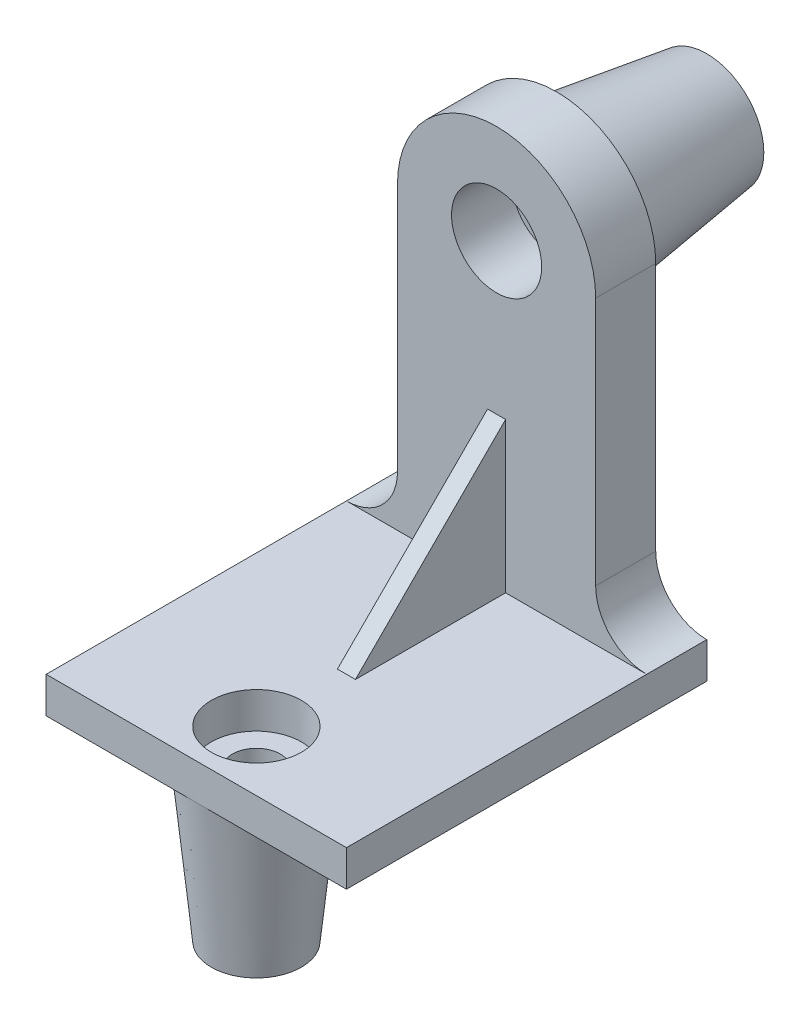
ISO-10303-21;
HEADER;
FILE_DESCRIPTION(('STEP AP214'),'2;1');
FILE_NAME('part.step','',(''),(''),'','','');
FILE_SCHEMA(('AUTOMOTIVE_DESIGN { 1 0 10303 214 1 1 1 1 }'));
ENDSEC;
DATA;
#1=APPLICATION_CONTEXT('core data for automotive mechanical design processes');
#2=APPLICATION_PROTOCOL_DEFINITION('international standard','automotive_design',2000,#1);
#3=PRODUCT_CONTEXT('',#1,'mechanical');
#4=PRODUCT('Part','Part','',(#3));
#5=PRODUCT_RELATED_PRODUCT_CATEGORY('part','',(#4));
#6=PRODUCT_DEFINITION_FORMATION('','',#4);
#7=PRODUCT_DEFINITION_CONTEXT('part definition',#1,'design');
#8=PRODUCT_DEFINITION('design','',#6,#7);
#9=PRODUCT_DEFINITION_SHAPE('','',#8);
#10=(LENGTH_UNIT() NAMED_UNIT(*) SI_UNIT(.MILLI.,.METRE.));
#11=(NAMED_UNIT(*) PLANE_ANGLE_UNIT() SI_UNIT($,.RADIAN.));
#12=(NAMED_UNIT(*) SI_UNIT($,.STERADIAN.) SOLID_ANGLE_UNIT());
#13=UNCERTAINTY_MEASURE_WITH_UNIT(LENGTH_MEASURE(1.E-05),#10,'distance_accuracy_value','');
#14=(GEOMETRIC_REPRESENTATION_CONTEXT(3) GLOBAL_UNCERTAINTY_ASSIGNED_CONTEXT((#13)) GLOBAL_UNIT_ASSIGNED_CONTEXT((#10,
#11,#12)) REPRESENTATION_CONTEXT('',''));
#15=CARTESIAN_POINT('',(0.,0.,0.));
#16=DIRECTION('',(0.,0.,1.));
#17=DIRECTION('',(1.,0.,0.));
#18=AXIS2_PLACEMENT_3D('',#15,#16,#17);
#19=CARTESIAN_POINT('',(0.,0.,20.));
#20=DIRECTION('',(0.,0.,1.));
#21=DIRECTION('',(1.,0.,0.));
#22=AXIS2_PLACEMENT_3D('',#19,#20,#21);
#23=PLANE('',#22);
#24=DIRECTION('',(0.,-1.,0.));
#25=VECTOR('',#24,1.);
#26=CARTESIAN_POINT('',(-36.,33.0000000000001,20.));
#27=LINE('',#26,#25);
#28=CARTESIAN_POINT('',(-36.,33.0000000000001,20.));
#29=VERTEX_POINT('',#28);
#30=CARTESIAN_POINT('',(-36.,-17.,20.));
#31=VERTEX_POINT('',#30);
#32=EDGE_CURVE('E330',#29,#31,#27,.T.);
#33=ORIENTED_EDGE('',*,*,#32,.F.);
#34=DIRECTION('',(-1.,0.,0.));
#35=VECTOR('',#34,1.);
#36=CARTESIAN_POINT('',(-36.,33.0000000000001,20.));
#37=LINE('',#36,#35);
#38=CARTESIAN_POINT('',(-30.,33.0000000000001,20.));
#39=VERTEX_POINT('',#38);
#40=EDGE_CURVE('E334',#39,#29,#37,.T.);
#41=ORIENTED_EDGE('',*,*,#40,.F.);
#42=DIRECTION('',(0.,1.,0.));
#43=VECTOR('',#42,1.);
#44=CARTESIAN_POINT('',(-30.,33.0000000000001,20.));
#45=LINE('',#44,#43);
#46=CARTESIAN_POINT('',(-30.,-17.,20.));
#47=VERTEX_POINT('',#46);
#48=EDGE_CURVE('E325',#47,#39,#45,.T.);
#49=ORIENTED_EDGE('',*,*,#48,.F.);
#50=DIRECTION('',(-1.,0.,0.));
#51=VECTOR('',#50,1.);
#52=CARTESIAN_POINT('',(-83.,-16.9999999999999,20.));
#53=LINE('',#52,#51);
#54=CARTESIAN_POINT('',(17.,-17.,20.));
#55=VERTEX_POINT('',#54);
#56=EDGE_CURVE('E170',#55,#47,#53,.T.);
#57=ORIENTED_EDGE('',*,*,#56,.F.);
#58=CARTESIAN_POINT('',(17.,0.,20.));
#59=DIRECTION('',(0.,0.,1.));
#60=DIRECTION('',(1.,0.,0.));
#61=AXIS2_PLACEMENT_3D('',#58,#59,#60);
#62=CIRCLE('',#61,17.);
#63=CARTESIAN_POINT('',(0.,0.,20.));
#64=VERTEX_POINT('',#63);
#65=EDGE_CURVE('E249',#64,#55,#62,.T.);
#66=ORIENTED_EDGE('',*,*,#65,.F.);
#67=DIRECTION('',(0.,1.,0.));
#68=VECTOR('',#67,1.);
#69=CARTESIAN_POINT('',(0.,0.,20.));
#70=LINE('',#69,#68);
#71=CARTESIAN_POINT('',(0.,83.,20.));
#72=VERTEX_POINT('',#71);
#73=EDGE_CURVE('E253',#64,#72,#70,.T.);
#74=ORIENTED_EDGE('',*,*,#73,.T.);
#75=CARTESIAN_POINT('',(-33.,83.,20.));
#76=DIRECTION('',(0.,0.,1.));
#77=DIRECTION('',(1.,0.,0.));
#78=AXIS2_PLACEMENT_3D('',#75,#76,#77);
#79=CIRCLE('',#78,33.);
#80=CARTESIAN_POINT('',(-66.,83.,20.));
#81=VERTEX_POINT('',#80);
#82=EDGE_CURVE('E256',#72,#81,#79,.T.);
#83=ORIENTED_EDGE('',*,*,#82,.T.);
#84=DIRECTION('',(0.,1.,0.));
#85=VECTOR('',#84,1.);
#86=CARTESIAN_POINT('',(-66.,0.,20.));
#87=LINE('',#86,#85);
#88=CARTESIAN_POINT('',(-66.,0.,20.));
#89=VERTEX_POINT('',#88);
#90=EDGE_CURVE('E241',#89,#81,#87,.T.);
#91=ORIENTED_EDGE('',*,*,#90,.F.);
#92=CARTESIAN_POINT('',(-83.,0.,20.));
#93=DIRECTION('',(0.,0.,1.));
#94=DIRECTION('',(1.,0.,0.));
#95=AXIS2_PLACEMENT_3D('',#92,#93,#94);
#96=CIRCLE('',#95,17.);
#97=CARTESIAN_POINT('',(-83.,-16.9999999999999,20.));
#98=VERTEX_POINT('',#97);
#99=EDGE_CURVE('E244',#89,#98,#96,.F.);
#100=ORIENTED_EDGE('',*,*,#99,.T.);
#101=EDGE_CURVE('E344',#31,#98,#53,.T.);
#102=ORIENTED_EDGE('',*,*,#101,.F.);
#103=EDGE_LOOP('',(#33,#41,#49,#57,#66,#74,#83,#91,#100,#102));
#104=FACE_BOUND('',#103,.T.);
#105=CARTESIAN_POINT('',(-33.,83.,20.));
#106=DIRECTION('',(0.,0.,1.));
#107=DIRECTION('',(1.,0.,0.));
#108=AXIS2_PLACEMENT_3D('',#105,#106,#107);
#109=CIRCLE('',#108,15.);
#110=CARTESIAN_POINT('',(-18.,83.,20.));
#111=VERTEX_POINT('',#110);
#112=EDGE_CURVE('E260',#111,#111,#109,.T.);
#113=ORIENTED_EDGE('',*,*,#112,.F.);
#114=EDGE_LOOP('',(#113));
#115=FACE_BOUND('',#114,.T.);
#116=ADVANCED_FACE('F45',(#104,#115),#23,.T.);
#117=CARTESIAN_POINT('',(-83.,-16.9999999999999,145.));
#118=DIRECTION('',(0.,-1.,0.));
#119=DIRECTION('',(1.,0.,0.));
#120=AXIS2_PLACEMENT_3D('',#117,#118,#119);
#121=PLANE('',#120);
#122=CARTESIAN_POINT('',(-33.,-17.,100.));
#123=DIRECTION('',(0.,1.,0.));
#124=DIRECTION('',(-1.,0.,0.));
#125=AXIS2_PLACEMENT_3D('',#122,#123,#124);
#126=CIRCLE('',#125,15.);
#127=CARTESIAN_POINT('',(-48.,-17.,100.));
#128=VERTEX_POINT('',#127);
#129=EDGE_CURVE('E309',#128,#128,#126,.T.);
#130=ORIENTED_EDGE('',*,*,#129,.F.);
#131=EDGE_LOOP('',(#130));
#132=FACE_BOUND('',#131,.T.);
#133=DIRECTION('',(0.,0.,-1.));
#134=VECTOR('',#133,1.);
#135=CARTESIAN_POINT('',(-83.,-16.9999999999999,145.));
#136=LINE('',#135,#134);
#137=CARTESIAN_POINT('',(-83.,-16.9999999999999,120.));
#138=VERTEX_POINT('',#137);
#139=EDGE_CURVE('E154',#138,#98,#136,.T.);
#140=ORIENTED_EDGE('',*,*,#139,.F.);
#141=DIRECTION('',(-1.,0.,0.));
#142=VECTOR('',#141,1.);
#143=CARTESIAN_POINT('',(17.,-17.,120.));
#144=LINE('',#143,#142);
#145=CARTESIAN_POINT('',(17.,-17.,120.));
#146=VERTEX_POINT('',#145);
#147=EDGE_CURVE('E68',#146,#138,#144,.T.);
#148=ORIENTED_EDGE('',*,*,#147,.F.);
#149=DIRECTION('',(0.,0.,-1.));
#150=VECTOR('',#149,1.);
#151=CARTESIAN_POINT('',(17.,-17.,145.));
#152=LINE('',#151,#150);
#153=EDGE_CURVE('E151',#146,#55,#152,.T.);
#154=ORIENTED_EDGE('',*,*,#153,.T.);
#155=ORIENTED_EDGE('',*,*,#56,.T.);
#156=DIRECTION('',(0.,0.,-1.));
#157=VECTOR('',#156,1.);
#158=CARTESIAN_POINT('',(-30.,-17.,70.));
#159=LINE('',#158,#157);
#160=CARTESIAN_POINT('',(-30.,-17.,70.));
#161=VERTEX_POINT('',#160);
#162=EDGE_CURVE('E342',#161,#47,#159,.T.);
#163=ORIENTED_EDGE('',*,*,#162,.F.);
#164=DIRECTION('',(1.,0.,0.));
#165=VECTOR('',#164,1.);
#166=CARTESIAN_POINT('',(-30.,-17.,70.));
#167=LINE('',#166,#165);
#168=CARTESIAN_POINT('',(-36.,-17.,70.));
#169=VERTEX_POINT('',#168);
#170=EDGE_CURVE('E326',#169,#161,#167,.T.);
#171=ORIENTED_EDGE('',*,*,#170,.F.);
#172=DIRECTION('',(0.,0.,-1.));
#173=VECTOR('',#172,1.);
#174=CARTESIAN_POINT('',(-36.,-17.,70.));
#175=LINE('',#174,#173);
#176=EDGE_CURVE('E329',#169,#31,#175,.T.);
#177=ORIENTED_EDGE('',*,*,#176,.T.);
#178=ORIENTED_EDGE('',*,*,#101,.T.);
#179=EDGE_LOOP('',(#140,#148,#154,#155,#163,#171,#177,#178));
#180=FACE_BOUND('',#179,.T.);
#181=ADVANCED_FACE('F149',(#132,#180),#121,.F.);
#182=CARTESIAN_POINT('',(-66.,0.,20.));
#183=DIRECTION('',(-1.,0.,0.));
#184=DIRECTION('',(0.,0.,1.));
#185=AXIS2_PLACEMENT_3D('',#182,#183,#184);
#186=PLANE('',#185);
#187=DIRECTION('',(0.,1.,0.));
#188=VECTOR('',#187,1.);
#189=CARTESIAN_POINT('',(-66.,0.,0.));
#190=LINE('',#189,#188);
#191=CARTESIAN_POINT('',(-66.,0.,0.));
#192=VERTEX_POINT('',#191);
#193=CARTESIAN_POINT('',(-66.,83.,0.));
#194=VERTEX_POINT('',#193);
#195=EDGE_CURVE('E238',#192,#194,#190,.T.);
#196=ORIENTED_EDGE('',*,*,#195,.F.);
#197=DIRECTION('',(0.,0.,-1.));
#198=VECTOR('',#197,1.);
#199=CARTESIAN_POINT('',(-66.,0.,20.));
#200=LINE('',#199,#198);
#201=EDGE_CURVE('E12',#89,#192,#200,.T.);
#202=ORIENTED_EDGE('',*,*,#201,.F.);
#203=ORIENTED_EDGE('',*,*,#90,.T.);
#204=DIRECTION('',(0.,0.,-1.));
#205=VECTOR('',#204,1.);
#206=CARTESIAN_POINT('',(-66.,83.,20.));
#207=LINE('',#206,#205);
#208=EDGE_CURVE('E264',#81,#194,#207,.T.);
#209=ORIENTED_EDGE('',*,*,#208,.T.);
#210=EDGE_LOOP('',(#196,#202,#203,#209));
#211=FACE_BOUND('',#210,.T.);
#212=ADVANCED_FACE('F47',(#211),#186,.T.);
#213=CARTESIAN_POINT('',(-83.,0.,20.));
#214=DIRECTION('',(0.,0.,-1.));
#215=DIRECTION('',(-1.,0.,0.));
#216=AXIS2_PLACEMENT_3D('',#213,#214,#215);
#217=CYLINDRICAL_SURFACE('',#216,17.);
#218=CARTESIAN_POINT('',(-83.,0.,0.));
#219=DIRECTION('',(0.,0.,1.));
#220=DIRECTION('',(1.,0.,0.));
#221=AXIS2_PLACEMENT_3D('',#218,#219,#220);
#222=CIRCLE('',#221,17.);
#223=CARTESIAN_POINT('',(-83.,-16.9999999999999,0.));
#224=VERTEX_POINT('',#223);
#225=EDGE_CURVE('E268',#192,#224,#222,.F.);
#226=ORIENTED_EDGE('',*,*,#225,.T.);
#227=DIRECTION('',(0.,0.,-1.));
#228=VECTOR('',#227,1.);
#229=CARTESIAN_POINT('',(-83.,-16.9999999999999,20.));
#230=LINE('',#229,#228);
#231=EDGE_CURVE('E55',#98,#224,#230,.T.);
#232=ORIENTED_EDGE('',*,*,#231,.F.);
#233=ORIENTED_EDGE('',*,*,#99,.F.);
#234=ORIENTED_EDGE('',*,*,#201,.T.);
#235=EDGE_LOOP('',(#226,#232,#233,#234));
#236=FACE_BOUND('',#235,.T.);
#237=ADVANCED_FACE('F356',(#236),#217,.F.);
#238=CARTESIAN_POINT('',(17.,0.,20.));
#239=DIRECTION('',(0.,0.,-1.));
#240=DIRECTION('',(-1.,0.,0.));
#241=AXIS2_PLACEMENT_3D('',#238,#239,#240);
#242=CYLINDRICAL_SURFACE('',#241,17.);
#243=CARTESIAN_POINT('',(17.,0.,0.));
#244=DIRECTION('',(0.,0.,1.));
#245=DIRECTION('',(1.,0.,0.));
#246=AXIS2_PLACEMENT_3D('',#243,#244,#245);
#247=CIRCLE('',#246,17.);
#248=CARTESIAN_POINT('',(0.,0.,0.));
#249=VERTEX_POINT('',#248);
#250=CARTESIAN_POINT('',(17.,-17.,0.));
#251=VERTEX_POINT('',#250);
#252=EDGE_CURVE('E271',#249,#251,#247,.T.);
#253=ORIENTED_EDGE('',*,*,#252,.F.);
#254=DIRECTION('',(0.,0.,-1.));
#255=VECTOR('',#254,1.);
#256=CARTESIAN_POINT('',(0.,0.,20.));
#257=LINE('',#256,#255);
#258=EDGE_CURVE('E290',#64,#249,#257,.T.);
#259=ORIENTED_EDGE('',*,*,#258,.F.);
#260=ORIENTED_EDGE('',*,*,#65,.T.);
#261=DIRECTION('',(0.,0.,-1.));
#262=VECTOR('',#261,1.);
#263=CARTESIAN_POINT('',(17.,-17.,20.));
#264=LINE('',#263,#262);
#265=EDGE_CURVE('E162',#55,#251,#264,.T.);
#266=ORIENTED_EDGE('',*,*,#265,.T.);
#267=EDGE_LOOP('',(#253,#259,#260,#266));
#268=FACE_BOUND('',#267,.T.);
#269=ADVANCED_FACE('F478',(#268),#242,.F.);
#270=CARTESIAN_POINT('',(0.,0.,20.));
#271=DIRECTION('',(-1.,0.,0.));
#272=DIRECTION('',(0.,0.,1.));
#273=AXIS2_PLACEMENT_3D('',#270,#271,#272);
#274=PLANE('',#273);
#275=DIRECTION('',(0.,1.,0.));
#276=VECTOR('',#275,1.);
#277=CARTESIAN_POINT('',(0.,0.,0.));
#278=LINE('',#277,#276);
#279=CARTESIAN_POINT('',(0.,83.,0.));
#280=VERTEX_POINT('',#279);
#281=EDGE_CURVE('E274',#249,#280,#278,.T.);
#282=ORIENTED_EDGE('',*,*,#281,.T.);
#283=DIRECTION('',(0.,0.,-1.));
#284=VECTOR('',#283,1.);
#285=CARTESIAN_POINT('',(0.,83.,20.));
#286=LINE('',#285,#284);
#287=EDGE_CURVE('E286',#72,#280,#286,.T.);
#288=ORIENTED_EDGE('',*,*,#287,.F.);
#289=ORIENTED_EDGE('',*,*,#73,.F.);
#290=ORIENTED_EDGE('',*,*,#258,.T.);
#291=EDGE_LOOP('',(#282,#288,#289,#290));
#292=FACE_BOUND('',#291,.T.);
#293=ADVANCED_FACE('F484',(#292),#274,.F.);
#294=CARTESIAN_POINT('',(-33.,83.,20.));
#295=DIRECTION('',(0.,0.,-1.));
#296=DIRECTION('',(-1.,0.,0.));
#297=AXIS2_PLACEMENT_3D('',#294,#295,#296);
#298=CYLINDRICAL_SURFACE('',#297,33.);
#299=CARTESIAN_POINT('',(-33.,83.,0.));
#300=DIRECTION('',(0.,0.,1.));
#301=DIRECTION('',(1.,0.,0.));
#302=AXIS2_PLACEMENT_3D('',#299,#300,#301);
#303=CIRCLE('',#302,33.);
#304=EDGE_CURVE('E277',#280,#194,#303,.T.);
#305=ORIENTED_EDGE('',*,*,#304,.T.);
#306=ORIENTED_EDGE('',*,*,#208,.F.);
#307=ORIENTED_EDGE('',*,*,#82,.F.);
#308=ORIENTED_EDGE('',*,*,#287,.T.);
#309=EDGE_LOOP('',(#305,#306,#307,#308));
#310=FACE_BOUND('',#309,.T.);
#311=ADVANCED_FACE('F492',(#310),#298,.T.);
#312=CARTESIAN_POINT('',(-33.,83.,20.));
#313=DIRECTION('',(0.,0.,-1.));
#314=DIRECTION('',(-1.,0.,0.));
#315=AXIS2_PLACEMENT_3D('',#312,#313,#314);
#316=CYLINDRICAL_SURFACE('',#315,15.);
#317=ORIENTED_EDGE('',*,*,#112,.T.);
#318=EDGE_LOOP('',(#317));
#319=FACE_BOUND('',#318,.T.);
#320=CARTESIAN_POINT('',(-33.,83.,0.));
#321=DIRECTION('',(0.,0.,1.));
#322=DIRECTION('',(1.,0.,0.));
#323=AXIS2_PLACEMENT_3D('',#320,#321,#322);
#324=CIRCLE('',#323,15.);
#325=CARTESIAN_POINT('',(-18.,83.,0.));
#326=VERTEX_POINT('',#325);
#327=EDGE_CURVE('E245',#326,#326,#324,.T.);
#328=ORIENTED_EDGE('',*,*,#327,.F.);
#329=EDGE_LOOP('',(#328));
#330=FACE_BOUND('',#329,.T.);
#331=ADVANCED_FACE('F500',(#319,#330),#316,.F.);
#332=CARTESIAN_POINT('',(0.,0.,0.));
#333=DIRECTION('',(0.,0.,1.));
#334=DIRECTION('',(1.,0.,0.));
#335=AXIS2_PLACEMENT_3D('',#332,#333,#334);
#336=PLANE('',#335);
#337=CARTESIAN_POINT('',(-33.,83.,0.));
#338=DIRECTION('',(0.,0.,-1.));
#339=DIRECTION('',(-1.,0.,0.));
#340=AXIS2_PLACEMENT_3D('',#337,#338,#339);
#341=CIRCLE('',#340,26.);
#342=CARTESIAN_POINT('',(-59.,83.,0.));
#343=VERTEX_POINT('',#342);
#344=EDGE_CURVE('E193',#343,#343,#341,.T.);
#345=ORIENTED_EDGE('',*,*,#344,.F.);
#346=EDGE_LOOP('',(#345));
#347=FACE_BOUND('',#346,.T.);
#348=ORIENTED_EDGE('',*,*,#195,.T.);
#349=ORIENTED_EDGE('',*,*,#304,.F.);
#350=ORIENTED_EDGE('',*,*,#281,.F.);
#351=ORIENTED_EDGE('',*,*,#252,.T.);
#352=DIRECTION('',(0.,-1.,0.));
#353=VECTOR('',#352,1.);
#354=CARTESIAN_POINT('',(17.,116.002,0.));
#355=LINE('',#354,#353);
#356=CARTESIAN_POINT('',(17.,-29.,0.));
#357=VERTEX_POINT('',#356);
#358=EDGE_CURVE('E184',#251,#357,#355,.T.);
#359=ORIENTED_EDGE('',*,*,#358,.T.);
#360=DIRECTION('',(-1.,0.,0.));
#361=VECTOR('',#360,1.);
#362=CARTESIAN_POINT('',(17.,-29.,0.));
#363=LINE('',#362,#361);
#364=CARTESIAN_POINT('',(-83.,-29.,0.));
#365=VERTEX_POINT('',#364);
#366=EDGE_CURVE('E168',#357,#365,#363,.T.);
#367=ORIENTED_EDGE('',*,*,#366,.T.);
#368=DIRECTION('',(0.,-1.,0.));
#369=VECTOR('',#368,1.);
#370=CARTESIAN_POINT('',(-83.,116.002,0.));
#371=LINE('',#370,#369);
#372=EDGE_CURVE('E180',#224,#365,#371,.T.);
#373=ORIENTED_EDGE('',*,*,#372,.F.);
#374=ORIENTED_EDGE('',*,*,#225,.F.);
#375=EDGE_LOOP('',(#348,#349,#350,#351,#359,#367,#373,#374));
#376=FACE_BOUND('',#375,.T.);
#377=ADVANCED_FACE('F218',(#347,#376),#336,.F.);
#378=CARTESIAN_POINT('',(-33.,83.,-50.));
#379=DIRECTION('',(0.,0.,1.));
#380=DIRECTION('',(1.,0.,0.));
#381=AXIS2_PLACEMENT_3D('',#378,#379,#380);
#382=CONICAL_SURFACE('',#381,19.,0.139095941482071);
#383=ORIENTED_EDGE('',*,*,#344,.T.);
#384=EDGE_LOOP('',(#383));
#385=FACE_BOUND('',#384,.T.);
#386=CARTESIAN_POINT('',(-33.,83.,-50.));
#387=DIRECTION('',(0.,0.,1.));
#388=DIRECTION('',(1.,0.,0.));
#389=AXIS2_PLACEMENT_3D('',#386,#387,#388);
#390=CIRCLE('',#389,19.);
#391=CARTESIAN_POINT('',(-14.,83.,-50.));
#392=VERTEX_POINT('',#391);
#393=EDGE_CURVE('E201',#392,#392,#390,.T.);
#394=ORIENTED_EDGE('',*,*,#393,.T.);
#395=EDGE_LOOP('',(#394));
#396=FACE_BOUND('',#395,.T.);
#397=ADVANCED_FACE('F207',(#385,#396),#382,.T.);
#398=CARTESIAN_POINT('',(-33.,83.,-50.));
#399=DIRECTION('',(0.,0.,1.));
#400=DIRECTION('',(1.,0.,0.));
#401=AXIS2_PLACEMENT_3D('',#398,#399,#400);
#402=PLANE('',#401);
#403=CARTESIAN_POINT('',(-33.,83.,-50.));
#404=DIRECTION('',(0.,0.,1.));
#405=DIRECTION('',(1.,0.,0.));
#406=AXIS2_PLACEMENT_3D('',#403,#404,#405);
#407=CIRCLE('',#406,10.);
#408=CARTESIAN_POINT('',(-23.,83.,-50.));
#409=VERTEX_POINT('',#408);
#410=EDGE_CURVE('E189',#409,#409,#407,.T.);
#411=ORIENTED_EDGE('',*,*,#410,.T.);
#412=EDGE_LOOP('',(#411));
#413=FACE_BOUND('',#412,.T.);
#414=ORIENTED_EDGE('',*,*,#393,.F.);
#415=EDGE_LOOP('',(#414));
#416=FACE_BOUND('',#415,.T.);
#417=ADVANCED_FACE('F217',(#413,#416),#402,.F.);
#418=CARTESIAN_POINT('',(-33.,83.,0.));
#419=DIRECTION('',(0.,0.,-1.));
#420=DIRECTION('',(-1.,0.,0.));
#421=AXIS2_PLACEMENT_3D('',#418,#419,#420);
#422=PLANE('',#421);
#423=CARTESIAN_POINT('',(-33.,83.,0.));
#424=DIRECTION('',(0.,0.,-1.));
#425=DIRECTION('',(-1.,0.,0.));
#426=AXIS2_PLACEMENT_3D('',#423,#424,#425);
#427=CIRCLE('',#426,10.);
#428=CARTESIAN_POINT('',(-43.,83.,0.));
#429=VERTEX_POINT('',#428);
#430=EDGE_CURVE('E188',#429,#429,#427,.T.);
#431=ORIENTED_EDGE('',*,*,#430,.T.);
#432=EDGE_LOOP('',(#431));
#433=FACE_BOUND('',#432,.T.);
#434=ORIENTED_EDGE('',*,*,#327,.T.);
#435=EDGE_LOOP('',(#434));
#436=FACE_BOUND('',#435,.T.);
#437=ADVANCED_FACE('F220',(#433,#436),#422,.F.);
#438=CARTESIAN_POINT('',(-33.,83.,20.001));
#439=DIRECTION('',(0.,0.,-1.));
#440=DIRECTION('',(-1.,0.,0.));
#441=AXIS2_PLACEMENT_3D('',#438,#439,#440);
#442=CYLINDRICAL_SURFACE('',#441,10.);
#443=ORIENTED_EDGE('',*,*,#410,.F.);
#444=EDGE_LOOP('',(#443));
#445=FACE_BOUND('',#444,.T.);
#446=ORIENTED_EDGE('',*,*,#430,.F.);
#447=EDGE_LOOP('',(#446));
#448=FACE_BOUND('',#447,.T.);
#449=ADVANCED_FACE('F447',(#445,#448),#442,.F.);
#450=CARTESIAN_POINT('',(17.,116.002,20.));
#451=DIRECTION('',(-1.,0.,0.));
#452=DIRECTION('',(0.,0.,1.));
#453=AXIS2_PLACEMENT_3D('',#450,#451,#452);
#454=PLANE('',#453);
#455=ORIENTED_EDGE('',*,*,#153,.F.);
#456=DIRECTION('',(0.,1.,0.));
#457=VECTOR('',#456,1.);
#458=CARTESIAN_POINT('',(17.,-29.0010000000001,120.));
#459=LINE('',#458,#457);
#460=CARTESIAN_POINT('',(17.,-29.,120.));
#461=VERTEX_POINT('',#460);
#462=EDGE_CURVE('E136',#461,#146,#459,.T.);
#463=ORIENTED_EDGE('',*,*,#462,.F.);
#464=DIRECTION('',(0.,0.,-1.));
#465=VECTOR('',#464,1.);
#466=CARTESIAN_POINT('',(17.,-29.,20.));
#467=LINE('',#466,#465);
#468=EDGE_CURVE('E164',#461,#357,#467,.T.);
#469=ORIENTED_EDGE('',*,*,#468,.T.);
#470=ORIENTED_EDGE('',*,*,#358,.F.);
#471=ORIENTED_EDGE('',*,*,#265,.F.);
#472=EDGE_LOOP('',(#455,#463,#469,#470,#471));
#473=FACE_BOUND('',#472,.T.);
#474=ADVANCED_FACE('F159',(#473),#454,.F.);
#475=CARTESIAN_POINT('',(0.,-29.,0.));
#476=DIRECTION('',(0.,1.,0.));
#477=DIRECTION('',(0.,0.,1.));
#478=AXIS2_PLACEMENT_3D('',#475,#476,#477);
#479=PLANE('',#478);
#480=DIRECTION('',(1.,0.,0.));
#481=VECTOR('',#480,1.);
#482=CARTESIAN_POINT('',(17.,-29.,120.));
#483=LINE('',#482,#481);
#484=CARTESIAN_POINT('',(-32.999197369888,-29.,120.));
#485=VERTEX_POINT('',#484);
#486=EDGE_CURVE('E140',#485,#461,#483,.T.);
#487=ORIENTED_EDGE('',*,*,#486,.F.);
#488=CARTESIAN_POINT('',(-33.,-29.,100.));
#489=DIRECTION('',(0.,-1.,0.));
#490=DIRECTION('',(0.,0.,-1.));
#491=AXIS2_PLACEMENT_3D('',#488,#489,#490);
#492=CIRCLE('',#491,20.);
#493=EDGE_CURVE('E61',#485,#485,#492,.T.);
#494=ORIENTED_EDGE('',*,*,#493,.F.);
#495=CARTESIAN_POINT('',(-83.,-29.,120.));
#496=VERTEX_POINT('',#495);
#497=EDGE_CURVE('E156',#496,#485,#483,.T.);
#498=ORIENTED_EDGE('',*,*,#497,.F.);
#499=DIRECTION('',(0.,0.,1.));
#500=VECTOR('',#499,1.);
#501=CARTESIAN_POINT('',(-83.,-29.,0.));
#502=LINE('',#501,#500);
#503=EDGE_CURVE('E177',#365,#496,#502,.T.);
#504=ORIENTED_EDGE('',*,*,#503,.F.);
#505=ORIENTED_EDGE('',*,*,#366,.F.);
#506=ORIENTED_EDGE('',*,*,#468,.F.);
#507=EDGE_LOOP('',(#487,#494,#498,#504,#505,#506));
#508=FACE_BOUND('',#507,.T.);
#509=ADVANCED_FACE('F373',(#508),#479,.F.);
#510=CARTESIAN_POINT('',(-83.,116.002,0.));
#511=DIRECTION('',(1.,0.,0.));
#512=DIRECTION('',(0.,0.,-1.));
#513=AXIS2_PLACEMENT_3D('',#510,#511,#512);
#514=PLANE('',#513);
#515=ORIENTED_EDGE('',*,*,#503,.T.);
#516=DIRECTION('',(0.,1.,0.));
#517=VECTOR('',#516,1.);
#518=CARTESIAN_POINT('',(-83.,-29.001,120.));
#519=LINE('',#518,#517);
#520=EDGE_CURVE('E145',#496,#138,#519,.T.);
#521=ORIENTED_EDGE('',*,*,#520,.T.);
#522=ORIENTED_EDGE('',*,*,#139,.T.);
#523=ORIENTED_EDGE('',*,*,#231,.T.);
#524=ORIENTED_EDGE('',*,*,#372,.T.);
#525=EDGE_LOOP('',(#515,#521,#522,#523,#524));
#526=FACE_BOUND('',#525,.T.);
#527=ADVANCED_FACE('F370',(#526),#514,.F.);
#528=CARTESIAN_POINT('',(-30.,33.0000000000001,70.));
#529=DIRECTION('',(-1.,0.,0.));
#530=DIRECTION('',(0.,0.,1.));
#531=AXIS2_PLACEMENT_3D('',#528,#529,#530);
#532=PLANE('',#531);
#533=ORIENTED_EDGE('',*,*,#48,.T.);
#534=DIRECTION('',(0.,0.707106781186548,-0.707106781186547));
#535=VECTOR('',#534,1.);
#536=CARTESIAN_POINT('',(-30.,-17.,70.));
#537=LINE('',#536,#535);
#538=EDGE_CURVE('E314',#161,#39,#537,.T.);
#539=ORIENTED_EDGE('',*,*,#538,.F.);
#540=ORIENTED_EDGE('',*,*,#162,.T.);
#541=EDGE_LOOP('',(#533,#539,#540));
#542=FACE_BOUND('',#541,.T.);
#543=ADVANCED_FACE('F434',(#542),#532,.F.);
#544=CARTESIAN_POINT('',(-36.,33.0000000000001,70.));
#545=DIRECTION('',(1.,0.,0.));
#546=DIRECTION('',(0.,0.,-1.));
#547=AXIS2_PLACEMENT_3D('',#544,#545,#546);
#548=PLANE('',#547);
#549=ORIENTED_EDGE('',*,*,#176,.F.);
#550=DIRECTION('',(0.,0.707106781186548,-0.707106781186547));
#551=VECTOR('',#550,1.);
#552=CARTESIAN_POINT('',(-36.,8.00000000000006,45.));
#553=LINE('',#552,#551);
#554=EDGE_CURVE('E321',#169,#29,#553,.T.);
#555=ORIENTED_EDGE('',*,*,#554,.T.);
#556=ORIENTED_EDGE('',*,*,#32,.T.);
#557=EDGE_LOOP('',(#549,#555,#556));
#558=FACE_BOUND('',#557,.T.);
#559=ADVANCED_FACE('F430',(#558),#548,.F.);
#560=CARTESIAN_POINT('',(-80.,-17.,70.));
#561=DIRECTION('',(0.,-0.707106781186547,-0.707106781186548));
#562=DIRECTION('',(0.,0.707106781186548,-0.707106781186547));
#563=AXIS2_PLACEMENT_3D('',#560,#561,#562);
#564=PLANE('',#563);
#565=ORIENTED_EDGE('',*,*,#170,.T.);
#566=ORIENTED_EDGE('',*,*,#538,.T.);
#567=ORIENTED_EDGE('',*,*,#40,.T.);
#568=ORIENTED_EDGE('',*,*,#554,.F.);
#569=EDGE_LOOP('',(#565,#566,#567,#568));
#570=FACE_BOUND('',#569,.T.);
#571=ADVANCED_FACE('F426',(#570),#564,.F.);
#572=CARTESIAN_POINT('',(-33.,-29.001,100.));
#573=DIRECTION('',(0.,1.,0.));
#574=DIRECTION('',(-1.,0.,0.));
#575=AXIS2_PLACEMENT_3D('',#572,#573,#574);
#576=CYLINDRICAL_SURFACE('',#575,15.);
#577=ORIENTED_EDGE('',*,*,#129,.T.);
#578=EDGE_LOOP('',(#577));
#579=FACE_BOUND('',#578,.T.);
#580=CARTESIAN_POINT('',(-33.,-29.,100.));
#581=DIRECTION('',(0.,1.,0.));
#582=DIRECTION('',(0.,0.,1.));
#583=AXIS2_PLACEMENT_3D('',#580,#581,#582);
#584=CIRCLE('',#583,15.);
#585=CARTESIAN_POINT('',(-33.,-29.,115.));
#586=VERTEX_POINT('',#585);
#587=EDGE_CURVE('E301',#586,#586,#584,.F.);
#588=ORIENTED_EDGE('',*,*,#587,.T.);
#589=EDGE_LOOP('',(#588));
#590=FACE_BOUND('',#589,.T.);
#591=ADVANCED_FACE('F423',(#579,#590),#576,.F.);
#592=CARTESIAN_POINT('',(17.,-29.0010000000001,120.));
#593=DIRECTION('',(0.,0.,-1.));
#594=DIRECTION('',(-1.,0.,0.));
#595=AXIS2_PLACEMENT_3D('',#592,#593,#594);
#596=PLANE('',#595);
#597=ORIENTED_EDGE('',*,*,#497,.T.);
#598=ORIENTED_EDGE('',*,*,#486,.T.);
#599=ORIENTED_EDGE('',*,*,#462,.T.);
#600=ORIENTED_EDGE('',*,*,#147,.T.);
#601=ORIENTED_EDGE('',*,*,#520,.F.);
#602=EDGE_LOOP('',(#597,#598,#599,#600,#601));
#603=FACE_BOUND('',#602,.T.);
#604=ADVANCED_FACE('F138',(#603),#596,.F.);
#605=CARTESIAN_POINT('',(-33.,-79.,100.));
#606=DIRECTION('',(0.,1.,0.));
#607=DIRECTION('',(0.,0.,1.));
#608=AXIS2_PLACEMENT_3D('',#605,#606,#607);
#609=CONICAL_SURFACE('',#608,15.,0.0996686524911619);
#610=ORIENTED_EDGE('',*,*,#493,.T.);
#611=EDGE_LOOP('',(#610));
#612=FACE_BOUND('',#611,.T.);
#613=CARTESIAN_POINT('',(-33.,-79.,100.));
#614=DIRECTION('',(0.,1.,0.));
#615=DIRECTION('',(0.,0.,1.));
#616=AXIS2_PLACEMENT_3D('',#613,#614,#615);
#617=CIRCLE('',#616,15.);
#618=CARTESIAN_POINT('',(-33.,-79.,115.));
#619=VERTEX_POINT('',#618);
#620=EDGE_CURVE('E318',#619,#619,#617,.T.);
#621=ORIENTED_EDGE('',*,*,#620,.T.);
#622=EDGE_LOOP('',(#621));
#623=FACE_BOUND('',#622,.T.);
#624=ADVANCED_FACE('F397',(#612,#623),#609,.T.);
#625=CARTESIAN_POINT('',(-33.,-79.,100.));
#626=DIRECTION('',(0.,1.,0.));
#627=DIRECTION('',(0.,0.,1.));
#628=AXIS2_PLACEMENT_3D('',#625,#626,#627);
#629=PLANE('',#628);
#630=CARTESIAN_POINT('',(-33.,-79.,100.));
#631=DIRECTION('',(0.,-1.,0.));
#632=DIRECTION('',(0.,0.,-1.));
#633=AXIS2_PLACEMENT_3D('',#630,#631,#632);
#634=CIRCLE('',#633,8.);
#635=CARTESIAN_POINT('',(-33.,-79.,92.));
#636=VERTEX_POINT('',#635);
#637=EDGE_CURVE('E382',#636,#636,#634,.T.);
#638=ORIENTED_EDGE('',*,*,#637,.F.);
#639=EDGE_LOOP('',(#638));
#640=FACE_BOUND('',#639,.T.);
#641=ORIENTED_EDGE('',*,*,#620,.F.);
#642=EDGE_LOOP('',(#641));
#643=FACE_BOUND('',#642,.T.);
#644=ADVANCED_FACE('F407',(#640,#643),#629,.F.);
#645=CARTESIAN_POINT('',(-33.,-29.,100.));
#646=DIRECTION('',(0.,-1.,0.));
#647=DIRECTION('',(0.,0.,-1.));
#648=AXIS2_PLACEMENT_3D('',#645,#646,#647);
#649=PLANE('',#648);
#650=CARTESIAN_POINT('',(-33.,-29.,100.));
#651=DIRECTION('',(0.,-1.,0.));
#652=DIRECTION('',(0.,0.,-1.));
#653=AXIS2_PLACEMENT_3D('',#650,#651,#652);
#654=CIRCLE('',#653,8.);
#655=CARTESIAN_POINT('',(-33.,-29.,92.));
#656=VERTEX_POINT('',#655);
#657=EDGE_CURVE('E379',#656,#656,#654,.F.);
#658=ORIENTED_EDGE('',*,*,#657,.F.);
#659=EDGE_LOOP('',(#658));
#660=FACE_BOUND('',#659,.T.);
#661=ORIENTED_EDGE('',*,*,#587,.F.);
#662=EDGE_LOOP('',(#661));
#663=FACE_BOUND('',#662,.T.);
#664=ADVANCED_FACE('F408',(#660,#663),#649,.F.);
#665=CARTESIAN_POINT('',(-33.,116.001,100.));
#666=DIRECTION('',(0.,-1.,0.));
#667=DIRECTION('',(0.,0.,-1.));
#668=AXIS2_PLACEMENT_3D('',#665,#666,#667);
#669=CYLINDRICAL_SURFACE('',#668,8.);
#670=ORIENTED_EDGE('',*,*,#637,.T.);
#671=EDGE_LOOP('',(#670));
#672=FACE_BOUND('',#671,.T.);
#673=ORIENTED_EDGE('',*,*,#657,.T.);
#674=EDGE_LOOP('',(#673));
#675=FACE_BOUND('',#674,.T.);
#676=ADVANCED_FACE('F610',(#672,#675),#669,.F.);
#677=CLOSED_SHELL('',(#116,#181,#212,#237,#269,#293,#311,#331,#377,#397,#417,#437,#449,#474,
#509,#527,#543,#559,#571,#591,#604,#624,#644,#664,#676));
#678=MANIFOLD_SOLID_BREP('B2',#677);
#679=ADVANCED_BREP_SHAPE_REPRESENTATION('',(#18,#678),#14);
#680=SHAPE_DEFINITION_REPRESENTATION(#9,#679);
ENDSEC;
END-ISO-10303-21;
